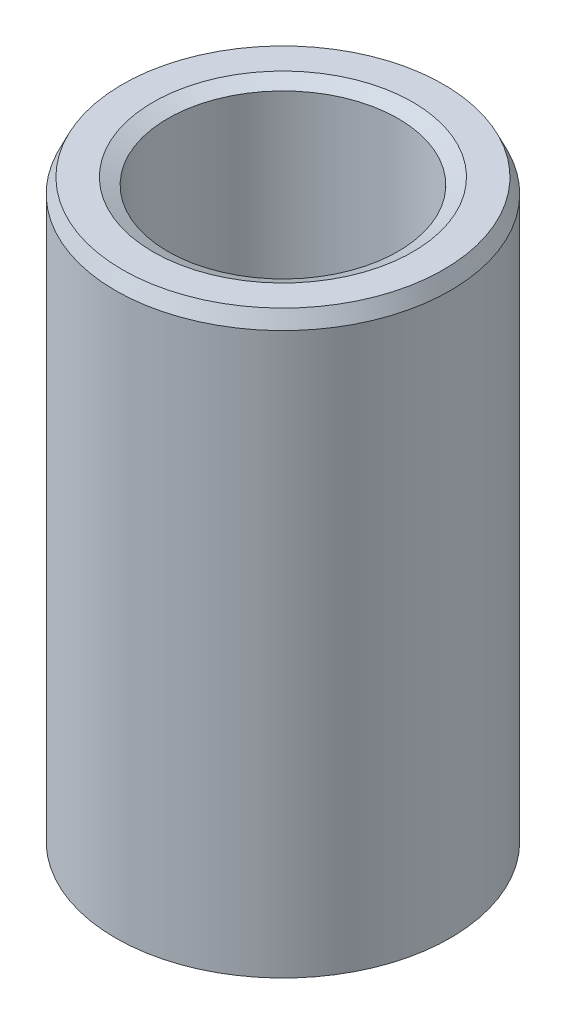
ISO-10303-21;
HEADER;
FILE_DESCRIPTION(('STEP AP214'),'2;1');
FILE_NAME('part.step','',(''),(''),'','','');
FILE_SCHEMA(('AUTOMOTIVE_DESIGN { 1 0 10303 214 1 1 1 1 }'));
ENDSEC;
DATA;
#1=APPLICATION_CONTEXT('core data for automotive mechanical design processes');
#2=APPLICATION_PROTOCOL_DEFINITION('international standard','automotive_design',2000,#1);
#3=PRODUCT_CONTEXT('',#1,'mechanical');
#4=PRODUCT('Part','Part','',(#3));
#5=PRODUCT_RELATED_PRODUCT_CATEGORY('part','',(#4));
#6=PRODUCT_DEFINITION_FORMATION('','',#4);
#7=PRODUCT_DEFINITION_CONTEXT('part definition',#1,'design');
#8=PRODUCT_DEFINITION('design','',#6,#7);
#9=PRODUCT_DEFINITION_SHAPE('','',#8);
#10=(LENGTH_UNIT() NAMED_UNIT(*) SI_UNIT(.MILLI.,.METRE.));
#11=(NAMED_UNIT(*) PLANE_ANGLE_UNIT() SI_UNIT($,.RADIAN.));
#12=(NAMED_UNIT(*) SI_UNIT($,.STERADIAN.) SOLID_ANGLE_UNIT());
#13=UNCERTAINTY_MEASURE_WITH_UNIT(LENGTH_MEASURE(1.E-05),#10,'distance_accuracy_value','');
#14=(GEOMETRIC_REPRESENTATION_CONTEXT(3) GLOBAL_UNCERTAINTY_ASSIGNED_CONTEXT((#13)) GLOBAL_UNIT_ASSIGNED_CONTEXT((#10,
#11,#12)) REPRESENTATION_CONTEXT('',''));
#15=CARTESIAN_POINT('',(0.,0.,0.));
#16=DIRECTION('',(0.,0.,1.));
#17=DIRECTION('',(1.,0.,0.));
#18=AXIS2_PLACEMENT_3D('',#15,#16,#17);
#19=CARTESIAN_POINT('',(0.,52.1590479512347,0.));
#20=DIRECTION('',(0.,-1.,0.));
#21=DIRECTION('',(0.,0.,-1.));
#22=AXIS2_PLACEMENT_3D('',#19,#20,#21);
#23=CYLINDRICAL_SURFACE('',#22,15.);
#24=CARTESIAN_POINT('',(0.,0.616349120217213,0.));
#25=DIRECTION('',(0.,1.,0.));
#26=DIRECTION('',(0.,0.,1.));
#27=AXIS2_PLACEMENT_3D('',#24,#25,#26);
#28=CIRCLE('',#27,15.);
#29=CARTESIAN_POINT('',(0.,0.616349120217213,15.));
#30=VERTEX_POINT('',#29);
#31=EDGE_CURVE('E10',#30,#30,#28,.T.);
#32=ORIENTED_EDGE('',*,*,#31,.T.);
#33=EDGE_LOOP('',(#32));
#34=FACE_BOUND('',#33,.T.);
#35=CARTESIAN_POINT('',(0.,50.8481290808714,0.));
#36=DIRECTION('',(0.,1.,0.));
#37=DIRECTION('',(0.,0.,1.));
#38=AXIS2_PLACEMENT_3D('',#35,#36,#37);
#39=CIRCLE('',#38,15.);
#40=CARTESIAN_POINT('',(0.,50.8481290808714,15.));
#41=VERTEX_POINT('',#40);
#42=EDGE_CURVE('E50',#41,#41,#39,.F.);
#43=ORIENTED_EDGE('',*,*,#42,.T.);
#44=EDGE_LOOP('',(#43));
#45=FACE_BOUND('',#44,.T.);
#46=ADVANCED_FACE('F39',(#34,#45),#23,.T.);
#47=CARTESIAN_POINT('',(0.,52.1590479512347,0.));
#48=DIRECTION('',(0.,1.,0.));
#49=DIRECTION('',(0.,0.,1.));
#50=AXIS2_PLACEMENT_3D('',#47,#48,#49);
#51=PLANE('',#50);
#52=CARTESIAN_POINT('',(0.,52.1590479512347,0.));
#53=DIRECTION('',(0.,1.,0.));
#54=DIRECTION('',(0.,0.,1.));
#55=AXIS2_PLACEMENT_3D('',#52,#53,#54);
#56=CIRCLE('',#55,11.6295187883427);
#57=CARTESIAN_POINT('',(0.,52.1590479512347,11.6295187883427));
#58=VERTEX_POINT('',#57);
#59=EDGE_CURVE('E58',#58,#58,#56,.F.);
#60=ORIENTED_EDGE('',*,*,#59,.T.);
#61=EDGE_LOOP('',(#60));
#62=FACE_BOUND('',#61,.T.);
#63=CARTESIAN_POINT('',(0.,52.1590479512347,0.));
#64=DIRECTION('',(0.,1.,0.));
#65=DIRECTION('',(0.,0.,1.));
#66=AXIS2_PLACEMENT_3D('',#63,#64,#65);
#67=CIRCLE('',#66,14.3836508797828);
#68=CARTESIAN_POINT('',(0.,52.1590479512347,14.3836508797828));
#69=VERTEX_POINT('',#68);
#70=EDGE_CURVE('E61',#69,#69,#67,.T.);
#71=ORIENTED_EDGE('',*,*,#70,.T.);
#72=EDGE_LOOP('',(#71));
#73=FACE_BOUND('',#72,.T.);
#74=ADVANCED_FACE('F88',(#62,#73),#51,.T.);
#75=CARTESIAN_POINT('',(0.,0.,0.));
#76=DIRECTION('',(0.,1.,0.));
#77=DIRECTION('',(0.,0.,1.));
#78=AXIS2_PLACEMENT_3D('',#75,#76,#77);
#79=PLANE('',#78);
#80=CARTESIAN_POINT('',(0.,0.,0.));
#81=DIRECTION('',(0.,1.,0.));
#82=DIRECTION('',(0.,0.,1.));
#83=AXIS2_PLACEMENT_3D('',#80,#81,#82);
#84=CIRCLE('',#83,10.9349490381965);
#85=CARTESIAN_POINT('',(0.,0.,10.9349490381965));
#86=VERTEX_POINT('',#85);
#87=EDGE_CURVE('E51',#86,#86,#84,.T.);
#88=ORIENTED_EDGE('',*,*,#87,.T.);
#89=EDGE_LOOP('',(#88));
#90=FACE_BOUND('',#89,.T.);
#91=CARTESIAN_POINT('',(0.,0.,0.));
#92=DIRECTION('',(0.,1.,0.));
#93=DIRECTION('',(0.,0.,1.));
#94=AXIS2_PLACEMENT_3D('',#91,#92,#93);
#95=CIRCLE('',#94,13.6890811296367);
#96=CARTESIAN_POINT('',(0.,0.,13.6890811296367));
#97=VERTEX_POINT('',#96);
#98=EDGE_CURVE('E54',#97,#97,#95,.F.);
#99=ORIENTED_EDGE('',*,*,#98,.T.);
#100=EDGE_LOOP('',(#99));
#101=FACE_BOUND('',#100,.T.);
#102=ADVANCED_FACE('F83',(#90,#101),#79,.F.);
#103=CARTESIAN_POINT('',(0.,52.1590479512347,0.));
#104=DIRECTION('',(0.,-1.,0.));
#105=DIRECTION('',(0.,0.,-1.));
#106=AXIS2_PLACEMENT_3D('',#103,#104,#105);
#107=CYLINDRICAL_SURFACE('',#106,10.3185999179793);
#108=CARTESIAN_POINT('',(0.,51.5426988310174,0.));
#109=DIRECTION('',(0.,1.,0.));
#110=DIRECTION('',(0.,0.,1.));
#111=AXIS2_PLACEMENT_3D('',#108,#109,#110);
#112=CIRCLE('',#111,10.3185999179793);
#113=CARTESIAN_POINT('',(0.,51.5426988310174,10.3185999179793));
#114=VERTEX_POINT('',#113);
#115=EDGE_CURVE('E67',#114,#114,#112,.T.);
#116=ORIENTED_EDGE('',*,*,#115,.T.);
#117=EDGE_LOOP('',(#116));
#118=FACE_BOUND('',#117,.T.);
#119=CARTESIAN_POINT('',(0.,1.31091887036333,0.));
#120=DIRECTION('',(0.,1.,0.));
#121=DIRECTION('',(0.,0.,1.));
#122=AXIS2_PLACEMENT_3D('',#119,#120,#121);
#123=CIRCLE('',#122,10.3185999179793);
#124=CARTESIAN_POINT('',(0.,1.31091887036333,10.3185999179793));
#125=VERTEX_POINT('',#124);
#126=EDGE_CURVE('E69',#125,#125,#123,.F.);
#127=ORIENTED_EDGE('',*,*,#126,.T.);
#128=EDGE_LOOP('',(#127));
#129=FACE_BOUND('',#128,.T.);
#130=ADVANCED_FACE('F71',(#118,#129),#107,.F.);
#131=CARTESIAN_POINT('',(0.,51.5426988310174,0.));
#132=DIRECTION('',(0.,1.,0.));
#133=DIRECTION('',(0.,0.,1.));
#134=AXIS2_PLACEMENT_3D('',#131,#132,#133);
#135=CONICAL_SURFACE('',#134,10.3185999179793,1.1312997086945);
#136=CARTESIAN_POINT('',(0.,52.1590479512347,11.6295187883427));
#137=CARTESIAN_POINT('',(0.,52.1526276478991,11.615863383443));
#138=CARTESIAN_POINT('',(0.,52.1462073445635,11.6022079785434));
#139=CARTESIAN_POINT('',(0.,52.1333667378923,11.5748971687442));
#140=CARTESIAN_POINT('',(0.,52.1269464345567,11.5612417638446));
#141=CARTESIAN_POINT('',(0.,52.1141058278855,11.5339309540453));
#142=CARTESIAN_POINT('',(0.,52.1076855245499,11.5202755491457));
#143=CARTESIAN_POINT('',(0.,52.0948449178787,11.4929647393465));
#144=CARTESIAN_POINT('',(0.,52.0884246145431,11.4793093344469));
#145=CARTESIAN_POINT('',(0.,52.0755840078719,11.4519985246476));
#146=CARTESIAN_POINT('',(0.,52.0691637045363,11.438343119748));
#147=CARTESIAN_POINT('',(0.,52.0563230978651,11.4110323099488));
#148=CARTESIAN_POINT('',(0.,52.0499027945295,11.3973769050492));
#149=CARTESIAN_POINT('',(0.,52.0370621878583,11.3700660952499));
#150=CARTESIAN_POINT('',(0.,52.0306418845227,11.3564106903503));
#151=CARTESIAN_POINT('',(0.,52.0178012778515,11.3290998805511));
#152=CARTESIAN_POINT('',(0.,52.011380974516,11.3154444756515));
#153=CARTESIAN_POINT('',(0.,51.9985403678448,11.2881336658522));
#154=CARTESIAN_POINT('',(0.,51.9921200645092,11.2744782609526));
#155=CARTESIAN_POINT('',(0.,51.979279457838,11.2471674511534));
#156=CARTESIAN_POINT('',(0.,51.9728591545024,11.2335120462537));
#157=CARTESIAN_POINT('',(0.,51.9600185478312,11.2062012364545));
#158=CARTESIAN_POINT('',(0.,51.9535982444956,11.1925458315549));
#159=CARTESIAN_POINT('',(0.,51.9407576378244,11.1652350217557));
#160=CARTESIAN_POINT('',(0.,51.9343373344888,11.151579616856));
#161=CARTESIAN_POINT('',(0.,51.9214967278176,11.1242688070568));
#162=CARTESIAN_POINT('',(0.,51.915076424482,11.1106134021572));
#163=CARTESIAN_POINT('',(0.,51.9022358178108,11.0833025923579));
#164=CARTESIAN_POINT('',(0.,51.8958155144752,11.0696471874583));
#165=CARTESIAN_POINT('',(0.,51.882974907804,11.0423363776591));
#166=CARTESIAN_POINT('',(0.,51.8765546044684,11.0286809727595));
#167=CARTESIAN_POINT('',(0.,51.8637139977972,11.0013701629602));
#168=CARTESIAN_POINT('',(0.,51.8572936944616,10.9877147580606));
#169=CARTESIAN_POINT('',(0.,51.8444530877904,10.9604039482614));
#170=CARTESIAN_POINT('',(0.,51.8380327844549,10.9467485433618));
#171=CARTESIAN_POINT('',(0.,51.8251921777837,10.9194377335625));
#172=CARTESIAN_POINT('',(0.,51.8187718744481,10.9057823286629));
#173=CARTESIAN_POINT('',(0.,51.8059312677769,10.8784715188637));
#174=CARTESIAN_POINT('',(0.,51.7995109644413,10.8648161139641));
#175=CARTESIAN_POINT('',(0.,51.7866703577701,10.8375053041648));
#176=CARTESIAN_POINT('',(0.,51.7802500544345,10.8238498992652));
#177=CARTESIAN_POINT('',(0.,51.7674094477633,10.796539089466));
#178=CARTESIAN_POINT('',(0.,51.7609891444277,10.7828836845663));
#179=CARTESIAN_POINT('',(0.,51.7481485377565,10.7555728747671));
#180=CARTESIAN_POINT('',(0.,51.7417282344209,10.7419174698675));
#181=CARTESIAN_POINT('',(0.,51.7288876277497,10.7146066600683));
#182=CARTESIAN_POINT('',(0.,51.7224673244141,10.7009512551686));
#183=CARTESIAN_POINT('',(0.,51.7096267177429,10.6736404453694));
#184=CARTESIAN_POINT('',(0.,51.7032064144073,10.6599850404698));
#185=CARTESIAN_POINT('',(0.,51.6903658077361,10.6326742306705));
#186=CARTESIAN_POINT('',(0.,51.6839455044005,10.6190188257709));
#187=CARTESIAN_POINT('',(0.,51.6711048977294,10.5917080159717));
#188=CARTESIAN_POINT('',(0.,51.6646845943938,10.5780526110721));
#189=CARTESIAN_POINT('',(0.,51.6518439877226,10.5507418012728));
#190=CARTESIAN_POINT('',(0.,51.645423684387,10.5370863963732));
#191=CARTESIAN_POINT('',(0.,51.6325830777158,10.509775586574));
#192=CARTESIAN_POINT('',(0.,51.6261627743802,10.4961201816744));
#193=CARTESIAN_POINT('',(0.,51.613322167709,10.4688093718751));
#194=CARTESIAN_POINT('',(0.,51.6069018643734,10.4551539669755));
#195=CARTESIAN_POINT('',(0.,51.5940612577022,10.4278431571763));
#196=CARTESIAN_POINT('',(0.,51.5876409543666,10.4141877522766));
#197=CARTESIAN_POINT('',(0.,51.5748003476954,10.3868769424774));
#198=CARTESIAN_POINT('',(0.,51.5683800443598,10.3732215375778));
#199=CARTESIAN_POINT('',(0.,51.5555394376886,10.3459107277786));
#200=CARTESIAN_POINT('',(0.,51.549119134353,10.3322553228789));
#201=CARTESIAN_POINT('',(0.,51.5426988310174,10.3185999179793));
#202=B_SPLINE_CURVE_WITH_KNOTS('',3,(#136,#137,#138,#139,#140,#141,#142,#143,#144,#145,#146,
#147,#148,#149,#150,#151,#152,#153,#154,#155,#156,#157,#158,#159,#160,#161,#162,#163,#164,#165,
#166,#167,#168,#169,#170,#171,#172,#173,#174,#175,#176,#177,#178,#179,#180,#181,#182,#183,#184,
#185,#186,#187,#188,#189,#190,#191,#192,#193,#194,#195,#196,#197,#198,#199,#200,#201),
.UNSPECIFIED.,.F.,.F.,(4,2,2,2,2,2,2,2,2,2,2,2,2,2,2,2,2,2,2,2,2,2,2,2,2,2,2,2,2,2,2,2,4),(0.,
0.0452682383249253,0.090536476649849,0.135804714974776,0.181072953299699,0.226341191624623,
0.271609429949551,0.316877668274475,0.362145906599402,0.407414144924325,0.452682383249249,
0.497950621574177,0.543218859899101,0.588487098224025,0.633755336548951,0.679023574873877,
0.724291813198803,0.769560051523727,0.814828289848651,0.860096528173577,0.905364766498503,
0.950633004823426,0.995901243148353,1.04116948147328,1.08643771979821,1.13170595812313,
1.17697419644805,1.22224243477298,1.2675106730979,1.31277891142283,1.35804714974776,
1.40331538807268,1.4485836263976),.UNSPECIFIED.);
#203=EDGE_CURVE('BSEAM77',#58,#114,#202,.T.);
#204=ORIENTED_EDGE('',*,*,#59,.F.);
#205=ORIENTED_EDGE('',*,*,#115,.F.);
#206=ORIENTED_EDGE('',*,*,#203,.T.);
#207=ORIENTED_EDGE('',*,*,#203,.F.);
#208=EDGE_LOOP('',(#204,#206,#205,#207));
#209=FACE_BOUND('',#208,.T.);
#210=ADVANCED_FACE('F77',(#209),#135,.F.);
#211=CARTESIAN_POINT('',(0.,0.,0.));
#212=DIRECTION('',(0.,-1.,0.));
#213=DIRECTION('',(0.,0.,-1.));
#214=AXIS2_PLACEMENT_3D('',#211,#212,#213);
#215=CONICAL_SURFACE('',#214,10.9349490381965,0.439496618100396);
#216=ORIENTED_EDGE('',*,*,#126,.F.);
#217=EDGE_LOOP('',(#216));
#218=FACE_BOUND('',#217,.T.);
#219=ORIENTED_EDGE('',*,*,#87,.F.);
#220=EDGE_LOOP('',(#219));
#221=FACE_BOUND('',#220,.T.);
#222=ADVANCED_FACE('F73',(#218,#221),#215,.F.);
#223=CARTESIAN_POINT('',(0.,0.616349120217213,0.));
#224=DIRECTION('',(0.,1.,0.));
#225=DIRECTION('',(0.,0.,1.));
#226=AXIS2_PLACEMENT_3D('',#223,#224,#225);
#227=CONICAL_SURFACE('',#226,15.,1.1312997086945);
#228=CARTESIAN_POINT('',(0.,0.,13.6890811296367));
#229=CARTESIAN_POINT('',(0.,0.00642030333559587,13.7027365345363));
#230=CARTESIAN_POINT('',(0.,0.0128406066711918,13.7163919394359));
#231=CARTESIAN_POINT('',(0.,0.0256812133423838,13.7437027492351));
#232=CARTESIAN_POINT('',(0.,0.0321015166779797,13.7573581541348));
#233=CARTESIAN_POINT('',(0.,0.0449421233491717,13.784668963934));
#234=CARTESIAN_POINT('',(0.,0.0513624266847677,13.7983243688336));
#235=CARTESIAN_POINT('',(0.,0.0642030333559596,13.8256351786328));
#236=CARTESIAN_POINT('',(0.,0.0706233366915556,13.8392905835325));
#237=CARTESIAN_POINT('',(0.,0.0834639433627475,13.8666013933317));
#238=CARTESIAN_POINT('',(0.,0.0898842466983435,13.8802567982313));
#239=CARTESIAN_POINT('',(0.,0.102724853369535,13.9075676080306));
#240=CARTESIAN_POINT('',(0.,0.109145156705131,13.9212230129302));
#241=CARTESIAN_POINT('',(0.,0.121985763376323,13.9485338227294));
#242=CARTESIAN_POINT('',(0.,0.128406066711919,13.962189227629));
#243=CARTESIAN_POINT('',(0.,0.141246673383111,13.9895000374283));
#244=CARTESIAN_POINT('',(0.,0.147666976718707,14.0031554423279));
#245=CARTESIAN_POINT('',(0.,0.160507583389899,14.0304662521271));
#246=CARTESIAN_POINT('',(0.,0.166927886725495,14.0441216570267));
#247=CARTESIAN_POINT('',(0.,0.179768493396687,14.071432466826));
#248=CARTESIAN_POINT('',(0.,0.186188796732283,14.0850878717256));
#249=CARTESIAN_POINT('',(0.,0.199029403403475,14.1123986815248));
#250=CARTESIAN_POINT('',(0.,0.205449706739071,14.1260540864244));
#251=CARTESIAN_POINT('',(0.,0.218290313410263,14.1533648962237));
#252=CARTESIAN_POINT('',(0.,0.224710616745859,14.1670203011233));
#253=CARTESIAN_POINT('',(0.,0.237551223417051,14.1943311109225));
#254=CARTESIAN_POINT('',(0.,0.243971526752647,14.2079865158222));
#255=CARTESIAN_POINT('',(0.,0.256812133423839,14.2352973256214));
#256=CARTESIAN_POINT('',(0.,0.263232436759435,14.248952730521));
#257=CARTESIAN_POINT('',(0.,0.276073043430627,14.2762635403202));
#258=CARTESIAN_POINT('',(0.,0.282493346766223,14.2899189452199));
#259=CARTESIAN_POINT('',(0.,0.295333953437415,14.3172297550191));
#260=CARTESIAN_POINT('',(0.,0.301754256773011,14.3308851599187));
#261=CARTESIAN_POINT('',(0.,0.314594863444203,14.358195969718));
#262=CARTESIAN_POINT('',(0.,0.321015166779798,14.3718513746176));
#263=CARTESIAN_POINT('',(0.,0.33385577345099,14.3991621844168));
#264=CARTESIAN_POINT('',(0.,0.340276076786586,14.4128175893164));
#265=CARTESIAN_POINT('',(0.,0.353116683457778,14.4401283991157));
#266=CARTESIAN_POINT('',(0.,0.359536986793374,14.4537838040153));
#267=CARTESIAN_POINT('',(0.,0.372377593464566,14.4810946138145));
#268=CARTESIAN_POINT('',(0.,0.378797896800162,14.4947500187141));
#269=CARTESIAN_POINT('',(0.,0.391638503471354,14.5220608285134));
#270=CARTESIAN_POINT('',(0.,0.39805880680695,14.535716233413));
#271=CARTESIAN_POINT('',(0.,0.410899413478142,14.5630270432122));
#272=CARTESIAN_POINT('',(0.,0.417319716813738,14.5766824481118));
#273=CARTESIAN_POINT('',(0.,0.43016032348493,14.6039932579111));
#274=CARTESIAN_POINT('',(0.,0.436580626820526,14.6176486628107));
#275=CARTESIAN_POINT('',(0.,0.449421233491718,14.6449594726099));
#276=CARTESIAN_POINT('',(0.,0.455841536827314,14.6586148775095));
#277=CARTESIAN_POINT('',(0.,0.468682143498506,14.6859256873088));
#278=CARTESIAN_POINT('',(0.,0.475102446834102,14.6995810922084));
#279=CARTESIAN_POINT('',(0.,0.487943053505294,14.7268919020076));
#280=CARTESIAN_POINT('',(0.,0.49436335684089,14.7405473069073));
#281=CARTESIAN_POINT('',(0.,0.507203963512082,14.7678581167065));
#282=CARTESIAN_POINT('',(0.,0.513624266847678,14.7815135216061));
#283=CARTESIAN_POINT('',(0.,0.52646487351887,14.8088243314053));
#284=CARTESIAN_POINT('',(0.,0.532885176854466,14.822479736305));
#285=CARTESIAN_POINT('',(0.,0.545725783525657,14.8497905461042));
#286=CARTESIAN_POINT('',(0.,0.552146086861254,14.8634459510038));
#287=CARTESIAN_POINT('',(0.,0.564986693532445,14.8907567608031));
#288=CARTESIAN_POINT('',(0.,0.571406996868041,14.9044121657027));
#289=CARTESIAN_POINT('',(0.,0.584247603539233,14.9317229755019));
#290=CARTESIAN_POINT('',(0.,0.590667906874829,14.9453783804015));
#291=CARTESIAN_POINT('',(0.,0.603508513546021,14.9726891902008));
#292=CARTESIAN_POINT('',(0.,0.609928816881617,14.9863445951004));
#293=CARTESIAN_POINT('',(0.,0.616349120217213,15.));
#294=B_SPLINE_CURVE_WITH_KNOTS('',3,(#228,#229,#230,#231,#232,#233,#234,#235,#236,#237,#238,
#239,#240,#241,#242,#243,#244,#245,#246,#247,#248,#249,#250,#251,#252,#253,#254,#255,#256,#257,
#258,#259,#260,#261,#262,#263,#264,#265,#266,#267,#268,#269,#270,#271,#272,#273,#274,#275,#276,
#277,#278,#279,#280,#281,#282,#283,#284,#285,#286,#287,#288,#289,#290,#291,#292,#293),
.UNSPECIFIED.,.F.,.F.,(4,2,2,2,2,2,2,2,2,2,2,2,2,2,2,2,2,2,2,2,2,2,2,2,2,2,2,2,2,2,2,2,4),(0.,
0.0452682383249248,0.0905364766498497,0.135804714974774,0.181072953299699,0.226341191624624,
0.271609429949549,0.316877668274474,0.362145906599399,0.407414144924323,0.452682383249248,
0.497950621574173,0.543218859899098,0.588487098224023,0.633755336548948,0.679023574873872,
0.724291813198797,0.769560051523722,0.814828289848647,0.860096528173572,0.905364766498496,
0.950633004823421,0.995901243148346,1.04116948147327,1.0864377197982,1.13170595812312,
1.17697419644805,1.22224243477297,1.2675106730979,1.31277891142282,1.35804714974775,
1.40331538807267,1.44858362639759),.UNSPECIFIED.);
#295=EDGE_CURVE('BSEAM76',#97,#30,#294,.T.);
#296=ORIENTED_EDGE('',*,*,#98,.F.);
#297=ORIENTED_EDGE('',*,*,#31,.F.);
#298=ORIENTED_EDGE('',*,*,#295,.T.);
#299=ORIENTED_EDGE('',*,*,#295,.F.);
#300=EDGE_LOOP('',(#296,#298,#297,#299));
#301=FACE_BOUND('',#300,.T.);
#302=ADVANCED_FACE('F76',(#301),#227,.T.);
#303=CARTESIAN_POINT('',(0.,52.1590479512347,0.));
#304=DIRECTION('',(0.,-1.,0.));
#305=DIRECTION('',(0.,0.,-1.));
#306=AXIS2_PLACEMENT_3D('',#303,#304,#305);
#307=CONICAL_SURFACE('',#306,14.3836508797828,0.439496618100396);
#308=ORIENTED_EDGE('',*,*,#42,.F.);
#309=EDGE_LOOP('',(#308));
#310=FACE_BOUND('',#309,.T.);
#311=ORIENTED_EDGE('',*,*,#70,.F.);
#312=EDGE_LOOP('',(#311));
#313=FACE_BOUND('',#312,.T.);
#314=ADVANCED_FACE('F45',(#310,#313),#307,.T.);
#315=CLOSED_SHELL('',(#46,#74,#102,#130,#210,#222,#302,#314));
#316=MANIFOLD_SOLID_BREP('B2',#315);
#317=ADVANCED_BREP_SHAPE_REPRESENTATION('',(#18,#316),#14);
#318=SHAPE_DEFINITION_REPRESENTATION(#9,#317);
ENDSEC;
END-ISO-10303-21;
